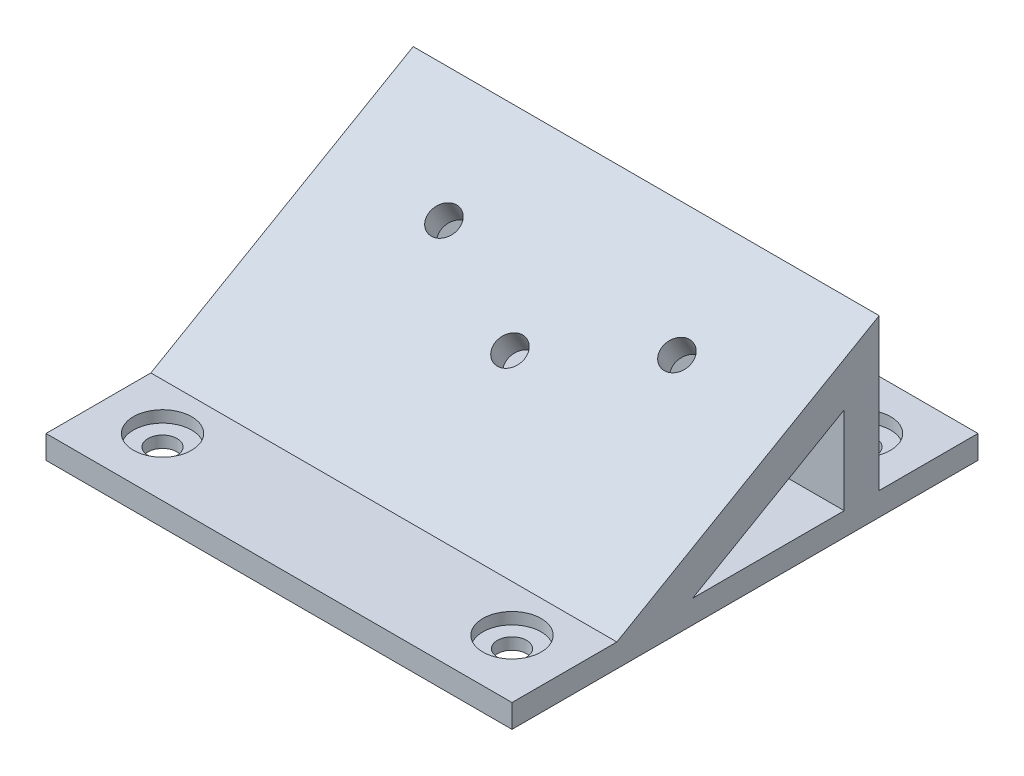
ISO-10303-21;
HEADER;
FILE_DESCRIPTION(('STEP AP214'),'2;1');
FILE_NAME('part.step','',(''),(''),'','','');
FILE_SCHEMA(('AUTOMOTIVE_DESIGN { 1 0 10303 214 1 1 1 1 }'));
ENDSEC;
DATA;
#1=APPLICATION_CONTEXT('core data for automotive mechanical design processes');
#2=APPLICATION_PROTOCOL_DEFINITION('international standard','automotive_design',2000,#1);
#3=PRODUCT_CONTEXT('',#1,'mechanical');
#4=PRODUCT('Part','Part','',(#3));
#5=PRODUCT_RELATED_PRODUCT_CATEGORY('part','',(#4));
#6=PRODUCT_DEFINITION_FORMATION('','',#4);
#7=PRODUCT_DEFINITION_CONTEXT('part definition',#1,'design');
#8=PRODUCT_DEFINITION('design','',#6,#7);
#9=PRODUCT_DEFINITION_SHAPE('','',#8);
#10=(LENGTH_UNIT() NAMED_UNIT(*) SI_UNIT(.MILLI.,.METRE.));
#11=(NAMED_UNIT(*) PLANE_ANGLE_UNIT() SI_UNIT($,.RADIAN.));
#12=(NAMED_UNIT(*) SI_UNIT($,.STERADIAN.) SOLID_ANGLE_UNIT());
#13=UNCERTAINTY_MEASURE_WITH_UNIT(LENGTH_MEASURE(1.E-05),#10,'distance_accuracy_value','');
#14=(GEOMETRIC_REPRESENTATION_CONTEXT(3) GLOBAL_UNCERTAINTY_ASSIGNED_CONTEXT((#13)) GLOBAL_UNIT_ASSIGNED_CONTEXT((#10,
#11,#12)) REPRESENTATION_CONTEXT('',''));
#15=CARTESIAN_POINT('',(0.,0.,0.));
#16=DIRECTION('',(0.,0.,1.));
#17=DIRECTION('',(1.,0.,0.));
#18=AXIS2_PLACEMENT_3D('',#15,#16,#17);
#19=CARTESIAN_POINT('',(-2.06920734142793,-499999.375,-288677.497796682));
#20=DIRECTION('',(0.,0.866025403784442,0.499999999999995));
#21=DIRECTION('',(0.,-0.499999999999995,0.866025403784442));
#22=AXIS2_PLACEMENT_3D('',#19,#20,#21);
#23=CYLINDRICAL_SURFACE('',#22,1.25);
#24=CARTESIAN_POINT('',(-2.06920734137785,10.7499999999999,3.48246960272194));
#25=DIRECTION('',(0.,0.866025403784442,0.499999999999995));
#26=DIRECTION('',(0.,-0.499999999999995,0.866025403784442));
#27=AXIS2_PLACEMENT_3D('',#24,#25,#26);
#28=CIRCLE('',#27,1.25);
#29=CARTESIAN_POINT('',(-2.06920734137785,10.1249999999999,4.56500135745249));
#30=VERTEX_POINT('',#29);
#31=EDGE_CURVE('E240',#30,#30,#28,.T.);
#32=ORIENTED_EDGE('',*,*,#31,.T.);
#33=EDGE_LOOP('',(#32));
#34=FACE_BOUND('',#33,.T.);
#35=CARTESIAN_POINT('',(-2.06920734137785,8.96743371487219,2.45330447813785));
#36=DIRECTION('',(0.,-0.866025403784438,-0.500000000000001));
#37=DIRECTION('',(0.,0.500000000000001,-0.866025403784438));
#38=AXIS2_PLACEMENT_3D('',#35,#36,#37);
#39=CIRCLE('',#38,1.25);
#40=CARTESIAN_POINT('',(-2.06920734137785,9.59243371487219,1.3707727234073));
#41=VERTEX_POINT('',#40);
#42=EDGE_CURVE('E37',#41,#41,#39,.F.);
#43=ORIENTED_EDGE('',*,*,#42,.F.);
#44=EDGE_LOOP('',(#43));
#45=FACE_BOUND('',#44,.T.);
#46=ADVANCED_FACE('F33',(#34,#45),#23,.F.);
#47=CARTESIAN_POINT('',(-12.0692073414279,-499999.375,-288671.72429399));
#48=DIRECTION('',(0.,0.866025403784442,0.499999999999995));
#49=DIRECTION('',(0.,-0.499999999999995,0.866025403784442));
#50=AXIS2_PLACEMENT_3D('',#47,#48,#49);
#51=CYLINDRICAL_SURFACE('',#50,1.25);
#52=CARTESIAN_POINT('',(-12.0692073413779,8.24999999999993,7.81259662164415));
#53=DIRECTION('',(0.,0.866025403784442,0.499999999999995));
#54=DIRECTION('',(0.,-0.499999999999995,0.866025403784442));
#55=AXIS2_PLACEMENT_3D('',#52,#53,#54);
#56=CIRCLE('',#55,1.25);
#57=CARTESIAN_POINT('',(-12.0692073413779,7.62499999999994,8.8951283763747));
#58=VERTEX_POINT('',#57);
#59=EDGE_CURVE('E244',#58,#58,#56,.T.);
#60=ORIENTED_EDGE('',*,*,#59,.T.);
#61=EDGE_LOOP('',(#60));
#62=FACE_BOUND('',#61,.T.);
#63=CARTESIAN_POINT('',(-12.0692073413779,6.46743371487446,6.78343149712646));
#64=DIRECTION('',(0.,-0.866025403784438,-0.500000000000001));
#65=DIRECTION('',(0.,0.500000000000001,-0.866025403784438));
#66=AXIS2_PLACEMENT_3D('',#63,#64,#65);
#67=CIRCLE('',#66,1.25);
#68=CARTESIAN_POINT('',(-12.0692073413779,7.09243371487446,5.70089974239591));
#69=VERTEX_POINT('',#68);
#70=EDGE_CURVE('E234',#69,#69,#67,.F.);
#71=ORIENTED_EDGE('',*,*,#70,.F.);
#72=EDGE_LOOP('',(#71));
#73=FACE_BOUND('',#72,.T.);
#74=ADVANCED_FACE('F304',(#62,#73),#51,.F.);
#75=CARTESIAN_POINT('',(-22.0692073414279,-499999.375,-288677.497796682));
#76=DIRECTION('',(0.,0.866025403784442,0.499999999999995));
#77=DIRECTION('',(0.,-0.499999999999995,0.866025403784442));
#78=AXIS2_PLACEMENT_3D('',#75,#76,#77);
#79=CYLINDRICAL_SURFACE('',#78,1.25);
#80=CARTESIAN_POINT('',(-22.0692073413779,10.7499999999999,3.48246960272194));
#81=DIRECTION('',(0.,0.866025403784442,0.499999999999995));
#82=DIRECTION('',(0.,-0.499999999999995,0.866025403784442));
#83=AXIS2_PLACEMENT_3D('',#80,#81,#82);
#84=CIRCLE('',#83,1.25);
#85=CARTESIAN_POINT('',(-22.0692073413779,10.1249999999999,4.56500135745249));
#86=VERTEX_POINT('',#85);
#87=EDGE_CURVE('E135',#86,#86,#84,.T.);
#88=ORIENTED_EDGE('',*,*,#87,.T.);
#89=EDGE_LOOP('',(#88));
#90=FACE_BOUND('',#89,.T.);
#91=CARTESIAN_POINT('',(-22.0692073413779,8.96743371487219,2.45330447813785));
#92=DIRECTION('',(0.,-0.866025403784438,-0.500000000000001));
#93=DIRECTION('',(0.,0.500000000000001,-0.866025403784438));
#94=AXIS2_PLACEMENT_3D('',#91,#92,#93);
#95=CIRCLE('',#94,1.25);
#96=CARTESIAN_POINT('',(-22.0692073413779,9.59243371487219,1.3707727234073));
#97=VERTEX_POINT('',#96);
#98=EDGE_CURVE('E232',#97,#97,#95,.F.);
#99=ORIENTED_EDGE('',*,*,#98,.F.);
#100=EDGE_LOOP('',(#99));
#101=FACE_BOUND('',#100,.T.);
#102=ADVANCED_FACE('F310',(#90,#101),#79,.F.);
#103=CARTESIAN_POINT('',(-32.0692073413778,2.,-12.3620858310503));
#104=DIRECTION('',(1.,0.,0.));
#105=DIRECTION('',(0.,0.,-1.));
#106=AXIS2_PLACEMENT_3D('',#103,#104,#105);
#107=PLANE('',#106);
#108=DIRECTION('',(0.,0.,1.));
#109=VECTOR('',#108,1.);
#110=CARTESIAN_POINT('',(-32.0692073413778,0.,-12.3620858310503));
#111=LINE('',#110,#109);
#112=CARTESIAN_POINT('',(-32.0692073413778,0.,-12.3620858310503));
#113=VERTEX_POINT('',#112);
#114=CARTESIAN_POINT('',(-32.0692073413778,0.,27.6379141689497));
#115=VERTEX_POINT('',#114);
#116=EDGE_CURVE('E193',#113,#115,#111,.T.);
#117=ORIENTED_EDGE('',*,*,#116,.T.);
#118=DIRECTION('',(0.,-1.,0.));
#119=VECTOR('',#118,1.);
#120=CARTESIAN_POINT('',(-32.0692073413778,2.,27.6379141689497));
#121=LINE('',#120,#119);
#122=CARTESIAN_POINT('',(-32.0692073413778,2.,27.6379141689497));
#123=VERTEX_POINT('',#122);
#124=EDGE_CURVE('E11',#123,#115,#121,.T.);
#125=ORIENTED_EDGE('',*,*,#124,.F.);
#126=DIRECTION('',(0.,0.,1.));
#127=VECTOR('',#126,1.);
#128=CARTESIAN_POINT('',(-32.0692073413778,2.,-12.3620858310503));
#129=LINE('',#128,#127);
#130=CARTESIAN_POINT('',(-32.0692073413778,2.,18.6379141689497));
#131=VERTEX_POINT('',#130);
#132=EDGE_CURVE('E198',#131,#123,#129,.T.);
#133=ORIENTED_EDGE('',*,*,#132,.F.);
#134=DIRECTION('',(0.,-0.499999999999995,0.866025403784442));
#135=VECTOR('',#134,1.);
#136=CARTESIAN_POINT('',(-32.0692073413779,14.9999999999999,-3.87874632944581));
#137=LINE('',#136,#135);
#138=CARTESIAN_POINT('',(-32.0692073413779,14.9999999999999,-3.87874632944581));
#139=VERTEX_POINT('',#138);
#140=EDGE_CURVE('E164',#139,#131,#137,.T.);
#141=ORIENTED_EDGE('',*,*,#140,.F.);
#142=DIRECTION('',(0.,-1.,0.));
#143=VECTOR('',#142,1.);
#144=CARTESIAN_POINT('',(-32.0692073413779,14.9999999999999,-3.87874632944581));
#145=LINE('',#144,#143);
#146=CARTESIAN_POINT('',(-32.0692073413779,2.,-3.87874632944577));
#147=VERTEX_POINT('',#146);
#148=EDGE_CURVE('E166',#139,#147,#145,.T.);
#149=ORIENTED_EDGE('',*,*,#148,.T.);
#150=CARTESIAN_POINT('',(-32.0692073413778,2.,-12.3620858310503));
#151=VERTEX_POINT('',#150);
#152=EDGE_CURVE('E194',#151,#147,#129,.T.);
#153=ORIENTED_EDGE('',*,*,#152,.F.);
#154=DIRECTION('',(0.,-1.,0.));
#155=VECTOR('',#154,1.);
#156=CARTESIAN_POINT('',(-32.0692073413778,2.,-12.3620858310503));
#157=LINE('',#156,#155);
#158=EDGE_CURVE('E206',#151,#113,#157,.T.);
#159=ORIENTED_EDGE('',*,*,#158,.T.);
#160=EDGE_LOOP('',(#117,#125,#133,#141,#149,#153,#159));
#161=FACE_BOUND('',#160,.T.);
#162=DIRECTION('',(0.,0.500000000000001,-0.866025403784438));
#163=VECTOR('',#162,1.);
#164=CARTESIAN_POINT('',(-32.0692073413779,2.,12.1212536705542));
#165=LINE('',#164,#163);
#166=CARTESIAN_POINT('',(-32.0692073413779,2.,12.1212536705542));
#167=VERTEX_POINT('',#166);
#168=CARTESIAN_POINT('',(-32.0692073413779,9.50555349946517,-0.878746329445838));
#169=VERTEX_POINT('',#168);
#170=EDGE_CURVE('E112',#167,#169,#165,.T.);
#171=ORIENTED_EDGE('',*,*,#170,.F.);
#172=DIRECTION('',(0.,0.,-1.));
#173=VECTOR('',#172,1.);
#174=CARTESIAN_POINT('',(-32.0692073413779,2.,12.1212536705542));
#175=LINE('',#174,#173);
#176=CARTESIAN_POINT('',(-32.0692073413778,2.,-0.878746329445823));
#177=VERTEX_POINT('',#176);
#178=EDGE_CURVE('E129',#167,#177,#175,.T.);
#179=ORIENTED_EDGE('',*,*,#178,.T.);
#180=DIRECTION('',(0.,-1.,0.));
#181=VECTOR('',#180,1.);
#182=CARTESIAN_POINT('',(-32.0692073413779,9.50555349946517,-0.878746329445838));
#183=LINE('',#182,#181);
#184=EDGE_CURVE('E120',#169,#177,#183,.T.);
#185=ORIENTED_EDGE('',*,*,#184,.F.);
#186=EDGE_LOOP('',(#171,#179,#185));
#187=FACE_BOUND('',#186,.T.);
#188=ADVANCED_FACE('F35',(#161,#187),#107,.F.);
#189=CARTESIAN_POINT('',(7.93079265862215,2.,-12.3620858310503));
#190=DIRECTION('',(-1.,0.,0.));
#191=DIRECTION('',(0.,0.,1.));
#192=AXIS2_PLACEMENT_3D('',#189,#190,#191);
#193=PLANE('',#192);
#194=DIRECTION('',(0.,0.,-1.));
#195=VECTOR('',#194,1.);
#196=CARTESIAN_POINT('',(7.93079265862215,0.,-12.3620858310503));
#197=LINE('',#196,#195);
#198=CARTESIAN_POINT('',(7.93079265862216,0.,27.6379141689497));
#199=VERTEX_POINT('',#198);
#200=CARTESIAN_POINT('',(7.93079265862215,0.,-12.3620858310503));
#201=VERTEX_POINT('',#200);
#202=EDGE_CURVE('E211',#199,#201,#197,.T.);
#203=ORIENTED_EDGE('',*,*,#202,.T.);
#204=DIRECTION('',(0.,-1.,0.));
#205=VECTOR('',#204,1.);
#206=CARTESIAN_POINT('',(7.93079265862215,2.,-12.3620858310503));
#207=LINE('',#206,#205);
#208=CARTESIAN_POINT('',(7.93079265862215,2.,-12.3620858310503));
#209=VERTEX_POINT('',#208);
#210=EDGE_CURVE('E217',#209,#201,#207,.T.);
#211=ORIENTED_EDGE('',*,*,#210,.F.);
#212=DIRECTION('',(0.,0.,-1.));
#213=VECTOR('',#212,1.);
#214=CARTESIAN_POINT('',(7.93079265862215,2.,-12.3620858310503));
#215=LINE('',#214,#213);
#216=CARTESIAN_POINT('',(7.93079265862215,2.,-3.87874632944578));
#217=VERTEX_POINT('',#216);
#218=EDGE_CURVE('E200',#217,#209,#215,.T.);
#219=ORIENTED_EDGE('',*,*,#218,.F.);
#220=DIRECTION('',(0.,-1.,0.));
#221=VECTOR('',#220,1.);
#222=CARTESIAN_POINT('',(7.93079265862215,14.9999999999999,-3.87874632944582));
#223=LINE('',#222,#221);
#224=CARTESIAN_POINT('',(7.93079265862215,14.9999999999999,-3.87874632944582));
#225=VERTEX_POINT('',#224);
#226=EDGE_CURVE('E167',#225,#217,#223,.T.);
#227=ORIENTED_EDGE('',*,*,#226,.F.);
#228=DIRECTION('',(0.,-0.499999999999995,0.866025403784442));
#229=VECTOR('',#228,1.);
#230=CARTESIAN_POINT('',(7.93079265862215,14.9999999999999,-3.87874632944582));
#231=LINE('',#230,#229);
#232=CARTESIAN_POINT('',(7.93079265862215,2.,18.6379141689497));
#233=VERTEX_POINT('',#232);
#234=EDGE_CURVE('E170',#225,#233,#231,.T.);
#235=ORIENTED_EDGE('',*,*,#234,.T.);
#236=CARTESIAN_POINT('',(7.93079265862216,2.,27.6379141689497));
#237=VERTEX_POINT('',#236);
#238=EDGE_CURVE('E201',#237,#233,#215,.T.);
#239=ORIENTED_EDGE('',*,*,#238,.F.);
#240=DIRECTION('',(0.,-1.,0.));
#241=VECTOR('',#240,1.);
#242=CARTESIAN_POINT('',(7.93079265862216,2.,27.6379141689497));
#243=LINE('',#242,#241);
#244=EDGE_CURVE('E42',#237,#199,#243,.T.);
#245=ORIENTED_EDGE('',*,*,#244,.T.);
#246=EDGE_LOOP('',(#203,#211,#219,#227,#235,#239,#245));
#247=FACE_BOUND('',#246,.T.);
#248=DIRECTION('',(0.,0.500000000000001,-0.866025403784438));
#249=VECTOR('',#248,1.);
#250=CARTESIAN_POINT('',(7.93079265862215,2.,12.1212536705542));
#251=LINE('',#250,#249);
#252=CARTESIAN_POINT('',(7.93079265862215,2.,12.1212536705542));
#253=VERTEX_POINT('',#252);
#254=CARTESIAN_POINT('',(7.93079265862215,9.50555349946517,-0.878746329445845));
#255=VERTEX_POINT('',#254);
#256=EDGE_CURVE('E58',#253,#255,#251,.T.);
#257=ORIENTED_EDGE('',*,*,#256,.T.);
#258=DIRECTION('',(0.,-1.,0.));
#259=VECTOR('',#258,1.);
#260=CARTESIAN_POINT('',(7.93079265862215,9.50555349946517,-0.878746329445845));
#261=LINE('',#260,#259);
#262=CARTESIAN_POINT('',(7.93079265862215,2.,-0.878746329445822));
#263=VERTEX_POINT('',#262);
#264=EDGE_CURVE('E126',#255,#263,#261,.T.);
#265=ORIENTED_EDGE('',*,*,#264,.T.);
#266=DIRECTION('',(0.,0.,-1.));
#267=VECTOR('',#266,1.);
#268=CARTESIAN_POINT('',(7.93079265862215,2.,12.1212536705542));
#269=LINE('',#268,#267);
#270=EDGE_CURVE('E121',#253,#263,#269,.T.);
#271=ORIENTED_EDGE('',*,*,#270,.F.);
#272=EDGE_LOOP('',(#257,#265,#271));
#273=FACE_BOUND('',#272,.T.);
#274=ADVANCED_FACE('F377',(#247,#273),#193,.F.);
#275=CARTESIAN_POINT('',(-27.0692073413778,0.,22.6379141689497));
#276=DIRECTION('',(0.,1.,0.));
#277=DIRECTION('',(0.,0.,1.));
#278=AXIS2_PLACEMENT_3D('',#275,#276,#277);
#279=CYLINDRICAL_SURFACE('',#278,1.25);
#280=CARTESIAN_POINT('',(-27.0692073413778,0.,22.6379141689497));
#281=DIRECTION('',(0.,1.,0.));
#282=DIRECTION('',(0.,0.,1.));
#283=AXIS2_PLACEMENT_3D('',#280,#281,#282);
#284=CIRCLE('',#283,1.25);
#285=CARTESIAN_POINT('',(-27.0692073413778,0.,23.8879141689497));
#286=VERTEX_POINT('',#285);
#287=EDGE_CURVE('E185',#286,#286,#284,.T.);
#288=ORIENTED_EDGE('',*,*,#287,.F.);
#289=EDGE_LOOP('',(#288));
#290=FACE_BOUND('',#289,.T.);
#291=CARTESIAN_POINT('',(-27.0692073413778,1.,22.6379141689497));
#292=DIRECTION('',(0.,1.,0.));
#293=DIRECTION('',(0.,0.,1.));
#294=AXIS2_PLACEMENT_3D('',#291,#292,#293);
#295=CIRCLE('',#294,1.25);
#296=CARTESIAN_POINT('',(-27.0692073413778,1.,23.8879141689497));
#297=VERTEX_POINT('',#296);
#298=EDGE_CURVE('E173',#297,#297,#295,.F.);
#299=ORIENTED_EDGE('',*,*,#298,.F.);
#300=EDGE_LOOP('',(#299));
#301=FACE_BOUND('',#300,.T.);
#302=ADVANCED_FACE('F365',(#290,#301),#279,.F.);
#303=CARTESIAN_POINT('',(-27.0692073413778,0.,-7.36208583105034));
#304=DIRECTION('',(0.,1.,0.));
#305=DIRECTION('',(0.,0.,1.));
#306=AXIS2_PLACEMENT_3D('',#303,#304,#305);
#307=CYLINDRICAL_SURFACE('',#306,1.25);
#308=CARTESIAN_POINT('',(-27.0692073413778,0.,-7.36208583105034));
#309=DIRECTION('',(0.,1.,0.));
#310=DIRECTION('',(0.,0.,1.));
#311=AXIS2_PLACEMENT_3D('',#308,#309,#310);
#312=CIRCLE('',#311,1.25);
#313=CARTESIAN_POINT('',(-27.0692073413778,0.,-6.11208583105034));
#314=VERTEX_POINT('',#313);
#315=EDGE_CURVE('E182',#314,#314,#312,.T.);
#316=ORIENTED_EDGE('',*,*,#315,.F.);
#317=EDGE_LOOP('',(#316));
#318=FACE_BOUND('',#317,.T.);
#319=CARTESIAN_POINT('',(-27.0692073413778,1.,-7.36208583105034));
#320=DIRECTION('',(0.,1.,0.));
#321=DIRECTION('',(0.,0.,1.));
#322=AXIS2_PLACEMENT_3D('',#319,#320,#321);
#323=CIRCLE('',#322,1.25);
#324=CARTESIAN_POINT('',(-27.0692073413778,1.,-6.11208583105034));
#325=VERTEX_POINT('',#324);
#326=EDGE_CURVE('E227',#325,#325,#323,.F.);
#327=ORIENTED_EDGE('',*,*,#326,.F.);
#328=EDGE_LOOP('',(#327));
#329=FACE_BOUND('',#328,.T.);
#330=ADVANCED_FACE('F361',(#318,#329),#307,.F.);
#331=CARTESIAN_POINT('',(2.93079265862216,0.,-7.36208583105034));
#332=DIRECTION('',(0.,1.,0.));
#333=DIRECTION('',(0.,0.,1.));
#334=AXIS2_PLACEMENT_3D('',#331,#332,#333);
#335=CYLINDRICAL_SURFACE('',#334,1.25);
#336=CARTESIAN_POINT('',(2.93079265862216,0.,-7.36208583105034));
#337=DIRECTION('',(0.,1.,0.));
#338=DIRECTION('',(0.,0.,1.));
#339=AXIS2_PLACEMENT_3D('',#336,#337,#338);
#340=CIRCLE('',#339,1.25);
#341=CARTESIAN_POINT('',(2.93079265862216,0.,-6.11208583105034));
#342=VERTEX_POINT('',#341);
#343=EDGE_CURVE('E186',#342,#342,#340,.T.);
#344=ORIENTED_EDGE('',*,*,#343,.F.);
#345=EDGE_LOOP('',(#344));
#346=FACE_BOUND('',#345,.T.);
#347=CARTESIAN_POINT('',(2.93079265862216,1.,-7.36208583105034));
#348=DIRECTION('',(0.,1.,0.));
#349=DIRECTION('',(0.,0.,1.));
#350=AXIS2_PLACEMENT_3D('',#347,#348,#349);
#351=CIRCLE('',#350,1.25);
#352=CARTESIAN_POINT('',(2.93079265862216,1.,-6.11208583105034));
#353=VERTEX_POINT('',#352);
#354=EDGE_CURVE('E224',#353,#353,#351,.F.);
#355=ORIENTED_EDGE('',*,*,#354,.F.);
#356=EDGE_LOOP('',(#355));
#357=FACE_BOUND('',#356,.T.);
#358=ADVANCED_FACE('F364',(#346,#357),#335,.F.);
#359=CARTESIAN_POINT('',(2.93079265862216,0.,22.6379141689497));
#360=DIRECTION('',(0.,1.,0.));
#361=DIRECTION('',(0.,0.,1.));
#362=AXIS2_PLACEMENT_3D('',#359,#360,#361);
#363=CYLINDRICAL_SURFACE('',#362,1.25);
#364=CARTESIAN_POINT('',(2.93079265862216,0.,22.6379141689497));
#365=DIRECTION('',(0.,1.,0.));
#366=DIRECTION('',(0.,0.,1.));
#367=AXIS2_PLACEMENT_3D('',#364,#365,#366);
#368=CIRCLE('',#367,1.25);
#369=CARTESIAN_POINT('',(2.93079265862216,0.,23.8879141689497));
#370=VERTEX_POINT('',#369);
#371=EDGE_CURVE('E177',#370,#370,#368,.T.);
#372=ORIENTED_EDGE('',*,*,#371,.F.);
#373=EDGE_LOOP('',(#372));
#374=FACE_BOUND('',#373,.T.);
#375=CARTESIAN_POINT('',(2.93079265862216,1.,22.6379141689497));
#376=DIRECTION('',(0.,1.,0.));
#377=DIRECTION('',(0.,0.,1.));
#378=AXIS2_PLACEMENT_3D('',#375,#376,#377);
#379=CIRCLE('',#378,1.25);
#380=CARTESIAN_POINT('',(2.93079265862216,1.,23.8879141689497));
#381=VERTEX_POINT('',#380);
#382=EDGE_CURVE('E161',#381,#381,#379,.F.);
#383=ORIENTED_EDGE('',*,*,#382,.F.);
#384=EDGE_LOOP('',(#383));
#385=FACE_BOUND('',#384,.T.);
#386=ADVANCED_FACE('F369',(#374,#385),#363,.F.);
#387=CARTESIAN_POINT('',(0.,2.,0.));
#388=DIRECTION('',(0.,1.,0.));
#389=DIRECTION('',(0.,0.,1.));
#390=AXIS2_PLACEMENT_3D('',#387,#388,#389);
#391=PLANE('',#390);
#392=CARTESIAN_POINT('',(-27.0692073413778,2.,-7.36208583105034));
#393=DIRECTION('',(0.,1.,0.));
#394=DIRECTION('',(0.,0.,1.));
#395=AXIS2_PLACEMENT_3D('',#392,#393,#394);
#396=CIRCLE('',#395,2.5);
#397=CARTESIAN_POINT('',(-27.0692073413778,2.,-4.86208583105034));
#398=VERTEX_POINT('',#397);
#399=EDGE_CURVE('E150',#398,#398,#396,.T.);
#400=ORIENTED_EDGE('',*,*,#399,.F.);
#401=EDGE_LOOP('',(#400));
#402=FACE_BOUND('',#401,.T.);
#403=CARTESIAN_POINT('',(2.93079265862216,2.,-7.36208583105034));
#404=DIRECTION('',(0.,1.,0.));
#405=DIRECTION('',(0.,0.,1.));
#406=AXIS2_PLACEMENT_3D('',#403,#404,#405);
#407=CIRCLE('',#406,2.5);
#408=CARTESIAN_POINT('',(2.93079265862216,2.,-4.86208583105034));
#409=VERTEX_POINT('',#408);
#410=EDGE_CURVE('E143',#409,#409,#407,.T.);
#411=ORIENTED_EDGE('',*,*,#410,.F.);
#412=EDGE_LOOP('',(#411));
#413=FACE_BOUND('',#412,.T.);
#414=ORIENTED_EDGE('',*,*,#152,.T.);
#415=DIRECTION('',(1.,0.,0.));
#416=VECTOR('',#415,1.);
#417=CARTESIAN_POINT('',(-32.0692073413779,2.,-3.87874632944577));
#418=LINE('',#417,#416);
#419=EDGE_CURVE('E178',#147,#217,#418,.T.);
#420=ORIENTED_EDGE('',*,*,#419,.T.);
#421=ORIENTED_EDGE('',*,*,#218,.T.);
#422=DIRECTION('',(-1.,0.,0.));
#423=VECTOR('',#422,1.);
#424=CARTESIAN_POINT('',(-32.0692073413778,2.,-12.3620858310503));
#425=LINE('',#424,#423);
#426=EDGE_CURVE('E204',#209,#151,#425,.T.);
#427=ORIENTED_EDGE('',*,*,#426,.T.);
#428=EDGE_LOOP('',(#414,#420,#421,#427));
#429=FACE_BOUND('',#428,.T.);
#430=ADVANCED_FACE('F373',(#402,#413,#429),#391,.T.);
#431=CARTESIAN_POINT('',(-32.0692073413778,2.,27.6379141689497));
#432=DIRECTION('',(0.,0.,-1.));
#433=DIRECTION('',(-1.,0.,0.));
#434=AXIS2_PLACEMENT_3D('',#431,#432,#433);
#435=PLANE('',#434);
#436=DIRECTION('',(1.,0.,0.));
#437=VECTOR('',#436,1.);
#438=CARTESIAN_POINT('',(-32.0692073413778,0.,27.6379141689497));
#439=LINE('',#438,#437);
#440=EDGE_CURVE('E209',#115,#199,#439,.T.);
#441=ORIENTED_EDGE('',*,*,#440,.T.);
#442=ORIENTED_EDGE('',*,*,#244,.F.);
#443=DIRECTION('',(1.,0.,0.));
#444=VECTOR('',#443,1.);
#445=CARTESIAN_POINT('',(-32.0692073413778,2.,27.6379141689497));
#446=LINE('',#445,#444);
#447=EDGE_CURVE('E197',#123,#237,#446,.T.);
#448=ORIENTED_EDGE('',*,*,#447,.F.);
#449=ORIENTED_EDGE('',*,*,#124,.T.);
#450=EDGE_LOOP('',(#441,#442,#448,#449));
#451=FACE_BOUND('',#450,.T.);
#452=ADVANCED_FACE('F389',(#451),#435,.F.);
#453=CARTESIAN_POINT('',(-32.0692073413778,2.,-12.3620858310503));
#454=DIRECTION('',(0.,0.,1.));
#455=DIRECTION('',(1.,0.,0.));
#456=AXIS2_PLACEMENT_3D('',#453,#454,#455);
#457=PLANE('',#456);
#458=DIRECTION('',(-1.,0.,0.));
#459=VECTOR('',#458,1.);
#460=CARTESIAN_POINT('',(-32.0692073413778,0.,-12.3620858310503));
#461=LINE('',#460,#459);
#462=EDGE_CURVE('E213',#201,#113,#461,.T.);
#463=ORIENTED_EDGE('',*,*,#462,.T.);
#464=ORIENTED_EDGE('',*,*,#158,.F.);
#465=ORIENTED_EDGE('',*,*,#426,.F.);
#466=ORIENTED_EDGE('',*,*,#210,.T.);
#467=EDGE_LOOP('',(#463,#464,#465,#466));
#468=FACE_BOUND('',#467,.T.);
#469=ADVANCED_FACE('F382',(#468),#457,.F.);
#470=CARTESIAN_POINT('',(-27.0692073413778,2.,22.6379141689497));
#471=DIRECTION('',(0.,1.,0.));
#472=DIRECTION('',(0.,0.,1.));
#473=AXIS2_PLACEMENT_3D('',#470,#471,#472);
#474=CIRCLE('',#473,2.5);
#475=CARTESIAN_POINT('',(-27.0692073413778,2.,25.1379141689497));
#476=VERTEX_POINT('',#475);
#477=EDGE_CURVE('E127',#476,#476,#474,.T.);
#478=ORIENTED_EDGE('',*,*,#477,.F.);
#479=EDGE_LOOP('',(#478));
#480=FACE_BOUND('',#479,.T.);
#481=CARTESIAN_POINT('',(2.93079265862216,2.,22.6379141689497));
#482=DIRECTION('',(0.,1.,0.));
#483=DIRECTION('',(0.,0.,1.));
#484=AXIS2_PLACEMENT_3D('',#481,#482,#483);
#485=CIRCLE('',#484,2.5);
#486=CARTESIAN_POINT('',(2.93079265862216,2.,25.1379141689497));
#487=VERTEX_POINT('',#486);
#488=EDGE_CURVE('E144',#487,#487,#485,.T.);
#489=ORIENTED_EDGE('',*,*,#488,.F.);
#490=EDGE_LOOP('',(#489));
#491=FACE_BOUND('',#490,.T.);
#492=DIRECTION('',(1.,0.,0.));
#493=VECTOR('',#492,1.);
#494=CARTESIAN_POINT('',(-32.0692073413778,2.,18.6379141689497));
#495=LINE('',#494,#493);
#496=EDGE_CURVE('E169',#131,#233,#495,.T.);
#497=ORIENTED_EDGE('',*,*,#496,.F.);
#498=ORIENTED_EDGE('',*,*,#132,.T.);
#499=ORIENTED_EDGE('',*,*,#447,.T.);
#500=ORIENTED_EDGE('',*,*,#238,.T.);
#501=EDGE_LOOP('',(#497,#498,#499,#500));
#502=FACE_BOUND('',#501,.T.);
#503=ADVANCED_FACE('F379',(#480,#491,#502),#391,.T.);
#504=CARTESIAN_POINT('',(0.,0.,0.));
#505=DIRECTION('',(0.,1.,0.));
#506=DIRECTION('',(0.,0.,1.));
#507=AXIS2_PLACEMENT_3D('',#504,#505,#506);
#508=PLANE('',#507);
#509=ORIENTED_EDGE('',*,*,#371,.T.);
#510=EDGE_LOOP('',(#509));
#511=FACE_BOUND('',#510,.T.);
#512=ORIENTED_EDGE('',*,*,#343,.T.);
#513=EDGE_LOOP('',(#512));
#514=FACE_BOUND('',#513,.T.);
#515=ORIENTED_EDGE('',*,*,#315,.T.);
#516=EDGE_LOOP('',(#515));
#517=FACE_BOUND('',#516,.T.);
#518=ORIENTED_EDGE('',*,*,#287,.T.);
#519=EDGE_LOOP('',(#518));
#520=FACE_BOUND('',#519,.T.);
#521=ORIENTED_EDGE('',*,*,#116,.F.);
#522=ORIENTED_EDGE('',*,*,#462,.F.);
#523=ORIENTED_EDGE('',*,*,#202,.F.);
#524=ORIENTED_EDGE('',*,*,#440,.F.);
#525=EDGE_LOOP('',(#521,#522,#523,#524));
#526=FACE_BOUND('',#525,.T.);
#527=ADVANCED_FACE('F359',(#511,#514,#517,#520,#526),#508,.F.);
#528=CARTESIAN_POINT('',(-32.0692073413779,14.9999999999999,-3.87874632944581));
#529=DIRECTION('',(0.,0.866025403784442,0.499999999999995));
#530=DIRECTION('',(0.,-0.499999999999995,0.866025403784442));
#531=AXIS2_PLACEMENT_3D('',#528,#529,#530);
#532=PLANE('',#531);
#533=ORIENTED_EDGE('',*,*,#87,.F.);
#534=EDGE_LOOP('',(#533));
#535=FACE_BOUND('',#534,.T.);
#536=ORIENTED_EDGE('',*,*,#59,.F.);
#537=EDGE_LOOP('',(#536));
#538=FACE_BOUND('',#537,.T.);
#539=ORIENTED_EDGE('',*,*,#31,.F.);
#540=EDGE_LOOP('',(#539));
#541=FACE_BOUND('',#540,.T.);
#542=ORIENTED_EDGE('',*,*,#234,.F.);
#543=DIRECTION('',(1.,0.,0.));
#544=VECTOR('',#543,1.);
#545=CARTESIAN_POINT('',(-32.0692073413779,14.9999999999999,-3.87874632944581));
#546=LINE('',#545,#544);
#547=EDGE_CURVE('E175',#139,#225,#546,.T.);
#548=ORIENTED_EDGE('',*,*,#547,.F.);
#549=ORIENTED_EDGE('',*,*,#140,.T.);
#550=ORIENTED_EDGE('',*,*,#496,.T.);
#551=EDGE_LOOP('',(#542,#548,#549,#550));
#552=FACE_BOUND('',#551,.T.);
#553=ADVANCED_FACE('F355',(#535,#538,#541,#552),#532,.T.);
#554=CARTESIAN_POINT('',(-32.0692073413779,14.9999999999999,-3.87874632944581));
#555=DIRECTION('',(0.,0.,1.));
#556=DIRECTION('',(0.,-1.,0.));
#557=AXIS2_PLACEMENT_3D('',#554,#555,#556);
#558=PLANE('',#557);
#559=ORIENTED_EDGE('',*,*,#226,.T.);
#560=ORIENTED_EDGE('',*,*,#419,.F.);
#561=ORIENTED_EDGE('',*,*,#148,.F.);
#562=ORIENTED_EDGE('',*,*,#547,.T.);
#563=EDGE_LOOP('',(#559,#560,#561,#562));
#564=FACE_BOUND('',#563,.T.);
#565=ADVANCED_FACE('F325',(#564),#558,.F.);
#566=CARTESIAN_POINT('',(2.93079265862216,1.,22.6379141689497));
#567=DIRECTION('',(0.,1.,0.));
#568=DIRECTION('',(0.,0.,1.));
#569=AXIS2_PLACEMENT_3D('',#566,#567,#568);
#570=PLANE('',#569);
#571=CARTESIAN_POINT('',(2.93079265862216,1.,22.6379141689497));
#572=DIRECTION('',(0.,1.,0.));
#573=DIRECTION('',(0.,0.,1.));
#574=AXIS2_PLACEMENT_3D('',#571,#572,#573);
#575=CIRCLE('',#574,2.5);
#576=CARTESIAN_POINT('',(2.93079265862216,1.,25.1379141689497));
#577=VERTEX_POINT('',#576);
#578=EDGE_CURVE('E140',#577,#577,#575,.T.);
#579=ORIENTED_EDGE('',*,*,#578,.T.);
#580=EDGE_LOOP('',(#579));
#581=FACE_BOUND('',#580,.T.);
#582=ORIENTED_EDGE('',*,*,#382,.T.);
#583=EDGE_LOOP('',(#582));
#584=FACE_BOUND('',#583,.T.);
#585=ADVANCED_FACE('F321',(#581,#584),#570,.T.);
#586=CARTESIAN_POINT('',(2.93079265862216,1.,22.6379141689497));
#587=DIRECTION('',(0.,1.,0.));
#588=DIRECTION('',(0.,0.,1.));
#589=AXIS2_PLACEMENT_3D('',#586,#587,#588);
#590=CYLINDRICAL_SURFACE('',#589,2.5);
#591=ORIENTED_EDGE('',*,*,#578,.F.);
#592=EDGE_LOOP('',(#591));
#593=FACE_BOUND('',#592,.T.);
#594=ORIENTED_EDGE('',*,*,#488,.T.);
#595=EDGE_LOOP('',(#594));
#596=FACE_BOUND('',#595,.T.);
#597=ADVANCED_FACE('F324',(#593,#596),#590,.F.);
#598=CARTESIAN_POINT('',(2.93079265862216,1.,-7.36208583105034));
#599=DIRECTION('',(0.,1.,0.));
#600=DIRECTION('',(0.,0.,1.));
#601=AXIS2_PLACEMENT_3D('',#598,#599,#600);
#602=PLANE('',#601);
#603=CARTESIAN_POINT('',(2.93079265862216,1.,-7.36208583105034));
#604=DIRECTION('',(0.,1.,0.));
#605=DIRECTION('',(0.,0.,1.));
#606=AXIS2_PLACEMENT_3D('',#603,#604,#605);
#607=CIRCLE('',#606,2.5);
#608=CARTESIAN_POINT('',(2.93079265862216,1.,-4.86208583105034));
#609=VERTEX_POINT('',#608);
#610=EDGE_CURVE('E158',#609,#609,#607,.T.);
#611=ORIENTED_EDGE('',*,*,#610,.T.);
#612=EDGE_LOOP('',(#611));
#613=FACE_BOUND('',#612,.T.);
#614=ORIENTED_EDGE('',*,*,#354,.T.);
#615=EDGE_LOOP('',(#614));
#616=FACE_BOUND('',#615,.T.);
#617=ADVANCED_FACE('F329',(#613,#616),#602,.T.);
#618=CARTESIAN_POINT('',(2.93079265862216,1.,-7.36208583105034));
#619=DIRECTION('',(0.,1.,0.));
#620=DIRECTION('',(0.,0.,1.));
#621=AXIS2_PLACEMENT_3D('',#618,#619,#620);
#622=CYLINDRICAL_SURFACE('',#621,2.5);
#623=ORIENTED_EDGE('',*,*,#610,.F.);
#624=EDGE_LOOP('',(#623));
#625=FACE_BOUND('',#624,.T.);
#626=ORIENTED_EDGE('',*,*,#410,.T.);
#627=EDGE_LOOP('',(#626));
#628=FACE_BOUND('',#627,.T.);
#629=ADVANCED_FACE('F335',(#625,#628),#622,.F.);
#630=CARTESIAN_POINT('',(-27.0692073413778,1.,-7.36208583105034));
#631=DIRECTION('',(0.,1.,0.));
#632=DIRECTION('',(0.,0.,1.));
#633=AXIS2_PLACEMENT_3D('',#630,#631,#632);
#634=PLANE('',#633);
#635=CARTESIAN_POINT('',(-27.0692073413778,1.,-7.36208583105034));
#636=DIRECTION('',(0.,1.,0.));
#637=DIRECTION('',(0.,0.,1.));
#638=AXIS2_PLACEMENT_3D('',#635,#636,#637);
#639=CIRCLE('',#638,2.5);
#640=CARTESIAN_POINT('',(-27.0692073413778,1.,-4.86208583105034));
#641=VERTEX_POINT('',#640);
#642=EDGE_CURVE('E147',#641,#641,#639,.T.);
#643=ORIENTED_EDGE('',*,*,#642,.T.);
#644=EDGE_LOOP('',(#643));
#645=FACE_BOUND('',#644,.T.);
#646=ORIENTED_EDGE('',*,*,#326,.T.);
#647=EDGE_LOOP('',(#646));
#648=FACE_BOUND('',#647,.T.);
#649=ADVANCED_FACE('F331',(#645,#648),#634,.T.);
#650=CARTESIAN_POINT('',(-27.0692073413778,1.,-7.36208583105034));
#651=DIRECTION('',(0.,1.,0.));
#652=DIRECTION('',(0.,0.,1.));
#653=AXIS2_PLACEMENT_3D('',#650,#651,#652);
#654=CYLINDRICAL_SURFACE('',#653,2.5);
#655=ORIENTED_EDGE('',*,*,#642,.F.);
#656=EDGE_LOOP('',(#655));
#657=FACE_BOUND('',#656,.T.);
#658=ORIENTED_EDGE('',*,*,#399,.T.);
#659=EDGE_LOOP('',(#658));
#660=FACE_BOUND('',#659,.T.);
#661=ADVANCED_FACE('F334',(#657,#660),#654,.F.);
#662=CARTESIAN_POINT('',(-27.0692073413778,1.,22.6379141689497));
#663=DIRECTION('',(0.,1.,0.));
#664=DIRECTION('',(0.,0.,1.));
#665=AXIS2_PLACEMENT_3D('',#662,#663,#664);
#666=PLANE('',#665);
#667=CARTESIAN_POINT('',(-27.0692073413778,1.,22.6379141689497));
#668=DIRECTION('',(0.,1.,0.));
#669=DIRECTION('',(0.,0.,1.));
#670=AXIS2_PLACEMENT_3D('',#667,#668,#669);
#671=CIRCLE('',#670,2.5);
#672=CARTESIAN_POINT('',(-27.0692073413778,1.,25.1379141689497));
#673=VERTEX_POINT('',#672);
#674=EDGE_CURVE('E153',#673,#673,#671,.T.);
#675=ORIENTED_EDGE('',*,*,#674,.T.);
#676=EDGE_LOOP('',(#675));
#677=FACE_BOUND('',#676,.T.);
#678=ORIENTED_EDGE('',*,*,#298,.T.);
#679=EDGE_LOOP('',(#678));
#680=FACE_BOUND('',#679,.T.);
#681=ADVANCED_FACE('F339',(#677,#680),#666,.T.);
#682=CARTESIAN_POINT('',(-27.0692073413778,1.,22.6379141689497));
#683=DIRECTION('',(0.,1.,0.));
#684=DIRECTION('',(0.,0.,1.));
#685=AXIS2_PLACEMENT_3D('',#682,#683,#684);
#686=CYLINDRICAL_SURFACE('',#685,2.5);
#687=ORIENTED_EDGE('',*,*,#674,.F.);
#688=EDGE_LOOP('',(#687));
#689=FACE_BOUND('',#688,.T.);
#690=ORIENTED_EDGE('',*,*,#477,.T.);
#691=EDGE_LOOP('',(#690));
#692=FACE_BOUND('',#691,.T.);
#693=ADVANCED_FACE('F282',(#689,#692),#686,.F.);
#694=CARTESIAN_POINT('',(-32.0692073413779,2.,12.1212536705542));
#695=DIRECTION('',(0.,-0.866025403784438,-0.500000000000001));
#696=DIRECTION('',(0.,0.500000000000001,-0.866025403784438));
#697=AXIS2_PLACEMENT_3D('',#694,#695,#696);
#698=PLANE('',#697);
#699=CARTESIAN_POINT('',(-22.0692073413779,7.9282032302785,1.85330447811791));
#700=DIRECTION('',(0.,-0.866025403784438,-0.500000000000001));
#701=DIRECTION('',(0.,0.500000000000001,-0.866025403784438));
#702=AXIS2_PLACEMENT_3D('',#699,#700,#701);
#703=CIRCLE('',#702,2.6);
#704=CARTESIAN_POINT('',(-22.0692073413779,9.2282032302785,-0.398361571721627));
#705=VERTEX_POINT('',#704);
#706=EDGE_CURVE('E264',#705,#705,#703,.T.);
#707=ORIENTED_EDGE('',*,*,#706,.F.);
#708=EDGE_LOOP('',(#707));
#709=FACE_BOUND('',#708,.T.);
#710=CARTESIAN_POINT('',(-2.06920734137785,7.9282032302785,1.85330447811791));
#711=DIRECTION('',(0.,-0.866025403784438,-0.500000000000001));
#712=DIRECTION('',(0.,0.500000000000001,-0.866025403784438));
#713=AXIS2_PLACEMENT_3D('',#710,#711,#712);
#714=CIRCLE('',#713,2.6);
#715=CARTESIAN_POINT('',(-2.06920734137785,9.2282032302785,-0.398361571721628));
#716=VERTEX_POINT('',#715);
#717=EDGE_CURVE('E261',#716,#716,#714,.T.);
#718=ORIENTED_EDGE('',*,*,#717,.F.);
#719=EDGE_LOOP('',(#718));
#720=FACE_BOUND('',#719,.T.);
#721=CARTESIAN_POINT('',(-12.0692073413779,5.4282032302503,6.18343149708893));
#722=DIRECTION('',(0.,-0.866025403784438,-0.500000000000001));
#723=DIRECTION('',(0.,0.500000000000001,-0.866025403784438));
#724=AXIS2_PLACEMENT_3D('',#721,#722,#723);
#725=CIRCLE('',#724,2.6);
#726=CARTESIAN_POINT('',(-12.0692073413779,6.72820323025031,3.93176544724939));
#727=VERTEX_POINT('',#726);
#728=EDGE_CURVE('E255',#727,#727,#725,.T.);
#729=ORIENTED_EDGE('',*,*,#728,.F.);
#730=EDGE_LOOP('',(#729));
#731=FACE_BOUND('',#730,.T.);
#732=ORIENTED_EDGE('',*,*,#256,.F.);
#733=DIRECTION('',(1.,0.,0.));
#734=VECTOR('',#733,1.);
#735=CARTESIAN_POINT('',(-32.0692073413779,2.,12.1212536705542));
#736=LINE('',#735,#734);
#737=EDGE_CURVE('E116',#167,#253,#736,.T.);
#738=ORIENTED_EDGE('',*,*,#737,.F.);
#739=ORIENTED_EDGE('',*,*,#170,.T.);
#740=DIRECTION('',(1.,0.,0.));
#741=VECTOR('',#740,1.);
#742=CARTESIAN_POINT('',(-32.0692073413779,9.50555349946517,-0.878746329445838));
#743=LINE('',#742,#741);
#744=EDGE_CURVE('E115',#169,#255,#743,.T.);
#745=ORIENTED_EDGE('',*,*,#744,.T.);
#746=EDGE_LOOP('',(#732,#738,#739,#745));
#747=FACE_BOUND('',#746,.T.);
#748=ADVANCED_FACE('F114',(#709,#720,#731,#747),#698,.T.);
#749=CARTESIAN_POINT('',(-32.0692073413779,9.50555349946517,-0.878746329445838));
#750=DIRECTION('',(0.,0.,1.));
#751=DIRECTION('',(0.,-1.,0.));
#752=AXIS2_PLACEMENT_3D('',#749,#750,#751);
#753=PLANE('',#752);
#754=ORIENTED_EDGE('',*,*,#264,.F.);
#755=ORIENTED_EDGE('',*,*,#744,.F.);
#756=ORIENTED_EDGE('',*,*,#184,.T.);
#757=DIRECTION('',(1.,0.,0.));
#758=VECTOR('',#757,1.);
#759=CARTESIAN_POINT('',(-32.0692073413779,2.,-0.878746329445815));
#760=LINE('',#759,#758);
#761=EDGE_CURVE('E50',#177,#263,#760,.T.);
#762=ORIENTED_EDGE('',*,*,#761,.T.);
#763=EDGE_LOOP('',(#754,#755,#756,#762));
#764=FACE_BOUND('',#763,.T.);
#765=ADVANCED_FACE('F124',(#764),#753,.T.);
#766=CARTESIAN_POINT('',(-32.0692073413779,2.,12.1212536705542));
#767=DIRECTION('',(0.,-1.,0.));
#768=DIRECTION('',(0.,0.,-1.));
#769=AXIS2_PLACEMENT_3D('',#766,#767,#768);
#770=PLANE('',#769);
#771=ORIENTED_EDGE('',*,*,#270,.T.);
#772=ORIENTED_EDGE('',*,*,#761,.F.);
#773=ORIENTED_EDGE('',*,*,#178,.F.);
#774=ORIENTED_EDGE('',*,*,#737,.T.);
#775=EDGE_LOOP('',(#771,#772,#773,#774));
#776=FACE_BOUND('',#775,.T.);
#777=ADVANCED_FACE('F316',(#776),#770,.F.);
#778=CARTESIAN_POINT('',(-22.0692073413779,8.96743371481983,2.45330447811791));
#779=DIRECTION('',(0.,-0.866025403784438,-0.500000000000001));
#780=DIRECTION('',(0.,0.500000000000001,-0.866025403784438));
#781=AXIS2_PLACEMENT_3D('',#778,#779,#780);
#782=PLANE('',#781);
#783=CARTESIAN_POINT('',(-22.0692073413779,8.96743371481983,2.45330447811791));
#784=DIRECTION('',(0.,-0.866025403784438,-0.500000000000001));
#785=DIRECTION('',(0.,0.500000000000001,-0.866025403784438));
#786=AXIS2_PLACEMENT_3D('',#783,#784,#785);
#787=CIRCLE('',#786,2.6);
#788=CARTESIAN_POINT('',(-22.0692073413779,10.2674337148198,0.201638428278375));
#789=VERTEX_POINT('',#788);
#790=EDGE_CURVE('E235',#789,#789,#787,.T.);
#791=ORIENTED_EDGE('',*,*,#790,.T.);
#792=EDGE_LOOP('',(#791));
#793=FACE_BOUND('',#792,.T.);
#794=ORIENTED_EDGE('',*,*,#98,.T.);
#795=EDGE_LOOP('',(#794));
#796=FACE_BOUND('',#795,.T.);
#797=ADVANCED_FACE('F270',(#793,#796),#782,.T.);
#798=CARTESIAN_POINT('',(-22.0692073413779,8.96743371481983,2.45330447811791));
#799=DIRECTION('',(0.,-0.866025403784438,-0.500000000000001));
#800=DIRECTION('',(0.,0.500000000000001,-0.866025403784438));
#801=AXIS2_PLACEMENT_3D('',#798,#799,#800);
#802=CYLINDRICAL_SURFACE('',#801,2.6);
#803=ORIENTED_EDGE('',*,*,#790,.F.);
#804=EDGE_LOOP('',(#803));
#805=FACE_BOUND('',#804,.T.);
#806=ORIENTED_EDGE('',*,*,#706,.T.);
#807=EDGE_LOOP('',(#806));
#808=FACE_BOUND('',#807,.T.);
#809=ADVANCED_FACE('F273',(#805,#808),#802,.F.);
#810=CARTESIAN_POINT('',(-12.0692073413779,6.46743371479163,6.78343149708893));
#811=DIRECTION('',(0.,-0.866025403784438,-0.500000000000001));
#812=DIRECTION('',(0.,0.500000000000001,-0.866025403784438));
#813=AXIS2_PLACEMENT_3D('',#810,#811,#812);
#814=PLANE('',#813);
#815=CARTESIAN_POINT('',(-12.0692073413779,6.46743371479163,6.78343149708893));
#816=DIRECTION('',(0.,-0.866025403784438,-0.500000000000001));
#817=DIRECTION('',(0.,0.500000000000001,-0.866025403784438));
#818=AXIS2_PLACEMENT_3D('',#815,#816,#817);
#819=CIRCLE('',#818,2.6);
#820=CARTESIAN_POINT('',(-12.0692073413779,7.76743371479163,4.53176544724939));
#821=VERTEX_POINT('',#820);
#822=EDGE_CURVE('E252',#821,#821,#819,.T.);
#823=ORIENTED_EDGE('',*,*,#822,.T.);
#824=EDGE_LOOP('',(#823));
#825=FACE_BOUND('',#824,.T.);
#826=ORIENTED_EDGE('',*,*,#70,.T.);
#827=EDGE_LOOP('',(#826));
#828=FACE_BOUND('',#827,.T.);
#829=ADVANCED_FACE('F276',(#825,#828),#814,.T.);
#830=CARTESIAN_POINT('',(-12.0692073413779,6.46743371479163,6.78343149708893));
#831=DIRECTION('',(0.,-0.866025403784438,-0.500000000000001));
#832=DIRECTION('',(0.,0.500000000000001,-0.866025403784438));
#833=AXIS2_PLACEMENT_3D('',#830,#831,#832);
#834=CYLINDRICAL_SURFACE('',#833,2.6);
#835=ORIENTED_EDGE('',*,*,#822,.F.);
#836=EDGE_LOOP('',(#835));
#837=FACE_BOUND('',#836,.T.);
#838=ORIENTED_EDGE('',*,*,#728,.T.);
#839=EDGE_LOOP('',(#838));
#840=FACE_BOUND('',#839,.T.);
#841=ADVANCED_FACE('F288',(#837,#840),#834,.F.);
#842=CARTESIAN_POINT('',(-2.06920734137785,8.96743371481982,2.45330447811791));
#843=DIRECTION('',(0.,-0.866025403784438,-0.500000000000001));
#844=DIRECTION('',(0.,0.500000000000001,-0.866025403784438));
#845=AXIS2_PLACEMENT_3D('',#842,#843,#844);
#846=PLANE('',#845);
#847=CARTESIAN_POINT('',(-2.06920734137785,8.96743371481982,2.45330447811791));
#848=DIRECTION('',(0.,-0.866025403784438,-0.500000000000001));
#849=DIRECTION('',(0.,0.500000000000001,-0.866025403784438));
#850=AXIS2_PLACEMENT_3D('',#847,#848,#849);
#851=CIRCLE('',#850,2.6);
#852=CARTESIAN_POINT('',(-2.06920734137785,10.2674337148198,0.201638428278373));
#853=VERTEX_POINT('',#852);
#854=EDGE_CURVE('E258',#853,#853,#851,.T.);
#855=ORIENTED_EDGE('',*,*,#854,.T.);
#856=EDGE_LOOP('',(#855));
#857=FACE_BOUND('',#856,.T.);
#858=ORIENTED_EDGE('',*,*,#42,.T.);
#859=EDGE_LOOP('',(#858));
#860=FACE_BOUND('',#859,.T.);
#861=ADVANCED_FACE('F290',(#857,#860),#846,.T.);
#862=CARTESIAN_POINT('',(-2.06920734137785,8.96743371481982,2.45330447811791));
#863=DIRECTION('',(0.,-0.866025403784438,-0.500000000000001));
#864=DIRECTION('',(0.,0.500000000000001,-0.866025403784438));
#865=AXIS2_PLACEMENT_3D('',#862,#863,#864);
#866=CYLINDRICAL_SURFACE('',#865,2.6);
#867=ORIENTED_EDGE('',*,*,#854,.F.);
#868=EDGE_LOOP('',(#867));
#869=FACE_BOUND('',#868,.T.);
#870=ORIENTED_EDGE('',*,*,#717,.T.);
#871=EDGE_LOOP('',(#870));
#872=FACE_BOUND('',#871,.T.);
#873=ADVANCED_FACE('F297',(#869,#872),#866,.F.);
#874=CLOSED_SHELL('',(#46,#74,#102,#188,#274,#302,#330,#358,#386,#430,#452,#469,#503,#527,#553,
#565,#585,#597,#617,#629,#649,#661,#681,#693,#748,#765,#777,#797,#809,#829,#841,#861,#873));
#875=MANIFOLD_SOLID_BREP('B2',#874);
#876=ADVANCED_BREP_SHAPE_REPRESENTATION('',(#18,#875),#14);
#877=SHAPE_DEFINITION_REPRESENTATION(#9,#876);
ENDSEC;
END-ISO-10303-21;
